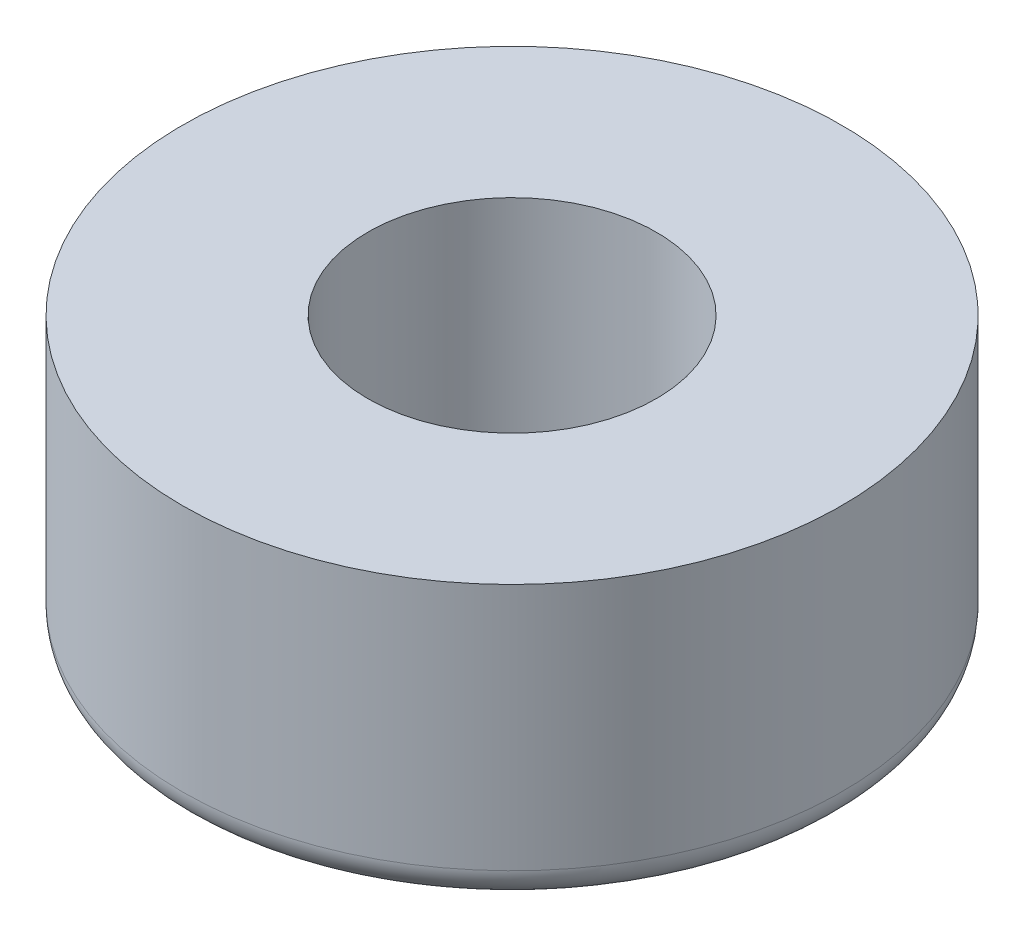
ISO-10303-21;
HEADER;
FILE_DESCRIPTION(('STEP AP214'),'2;1');
FILE_NAME('part.step','',(''),(''),'','','');
FILE_SCHEMA(('AUTOMOTIVE_DESIGN { 1 0 10303 214 1 1 1 1 }'));
ENDSEC;
DATA;
#1=APPLICATION_CONTEXT('core data for automotive mechanical design processes');
#2=APPLICATION_PROTOCOL_DEFINITION('international standard','automotive_design',2000,#1);
#3=PRODUCT_CONTEXT('',#1,'mechanical');
#4=PRODUCT('Part','Part','',(#3));
#5=PRODUCT_RELATED_PRODUCT_CATEGORY('part','',(#4));
#6=PRODUCT_DEFINITION_FORMATION('','',#4);
#7=PRODUCT_DEFINITION_CONTEXT('part definition',#1,'design');
#8=PRODUCT_DEFINITION('design','',#6,#7);
#9=PRODUCT_DEFINITION_SHAPE('','',#8);
#10=(LENGTH_UNIT() NAMED_UNIT(*) SI_UNIT(.MILLI.,.METRE.));
#11=(NAMED_UNIT(*) PLANE_ANGLE_UNIT() SI_UNIT($,.RADIAN.));
#12=(NAMED_UNIT(*) SI_UNIT($,.STERADIAN.) SOLID_ANGLE_UNIT());
#13=UNCERTAINTY_MEASURE_WITH_UNIT(LENGTH_MEASURE(1.E-05),#10,'distance_accuracy_value','');
#14=(GEOMETRIC_REPRESENTATION_CONTEXT(3) GLOBAL_UNCERTAINTY_ASSIGNED_CONTEXT((#13)) GLOBAL_UNIT_ASSIGNED_CONTEXT((#10,
#11,#12)) REPRESENTATION_CONTEXT('',''));
#15=CARTESIAN_POINT('',(0.,0.,0.));
#16=DIRECTION('',(0.,0.,1.));
#17=DIRECTION('',(1.,0.,0.));
#18=AXIS2_PLACEMENT_3D('',#15,#16,#17);
#19=CARTESIAN_POINT('',(0.,6.731,0.));
#20=DIRECTION('',(0.,1.,0.));
#21=DIRECTION('',(0.,0.,1.));
#22=AXIS2_PLACEMENT_3D('',#19,#20,#21);
#23=PLANE('',#22);
#24=CARTESIAN_POINT('',(0.,6.731,0.));
#25=DIRECTION('',(0.,1.,0.));
#26=DIRECTION('',(0.,0.,1.));
#27=AXIS2_PLACEMENT_3D('',#24,#25,#26);
#28=CIRCLE('',#27,7.9375);
#29=CARTESIAN_POINT('',(0.,6.731,7.9375));
#30=VERTEX_POINT('',#29);
#31=EDGE_CURVE('E42',#30,#30,#28,.T.);
#32=ORIENTED_EDGE('',*,*,#31,.T.);
#33=EDGE_LOOP('',(#32));
#34=FACE_BOUND('',#33,.T.);
#35=CARTESIAN_POINT('',(0.,6.731,0.));
#36=DIRECTION('',(0.,1.,0.));
#37=DIRECTION('',(0.,0.,1.));
#38=AXIS2_PLACEMENT_3D('',#35,#36,#37);
#39=CIRCLE('',#38,3.475000035);
#40=CARTESIAN_POINT('',(0.,6.731,3.475000035));
#41=VERTEX_POINT('',#40);
#42=EDGE_CURVE('E46',#41,#41,#39,.T.);
#43=ORIENTED_EDGE('',*,*,#42,.F.);
#44=EDGE_LOOP('',(#43));
#45=FACE_BOUND('',#44,.T.);
#46=ADVANCED_FACE('F31',(#34,#45),#23,.T.);
#47=CARTESIAN_POINT('',(0.,0.,0.));
#48=DIRECTION('',(0.,1.,0.));
#49=DIRECTION('',(0.,0.,1.));
#50=AXIS2_PLACEMENT_3D('',#47,#48,#49);
#51=PLANE('',#50);
#52=CARTESIAN_POINT('',(0.,0.,0.));
#53=DIRECTION('',(0.,1.,0.));
#54=DIRECTION('',(0.,0.,1.));
#55=AXIS2_PLACEMENT_3D('',#52,#53,#54);
#56=CIRCLE('',#55,7.1775);
#57=CARTESIAN_POINT('',(0.,0.,7.1775));
#58=VERTEX_POINT('',#57);
#59=EDGE_CURVE('E10',#58,#58,#56,.F.);
#60=ORIENTED_EDGE('',*,*,#59,.T.);
#61=EDGE_LOOP('',(#60));
#62=FACE_BOUND('',#61,.T.);
#63=CARTESIAN_POINT('',(0.,0.,0.));
#64=DIRECTION('',(0.,1.,0.));
#65=DIRECTION('',(0.,0.,1.));
#66=AXIS2_PLACEMENT_3D('',#63,#64,#65);
#67=CIRCLE('',#66,3.475000035);
#68=CARTESIAN_POINT('',(0.,0.,3.475000035));
#69=VERTEX_POINT('',#68);
#70=EDGE_CURVE('E49',#69,#69,#67,.T.);
#71=ORIENTED_EDGE('',*,*,#70,.T.);
#72=EDGE_LOOP('',(#71));
#73=FACE_BOUND('',#72,.T.);
#74=ADVANCED_FACE('F59',(#62,#73),#51,.F.);
#75=CARTESIAN_POINT('',(0.,6.731,0.));
#76=DIRECTION('',(0.,-1.,0.));
#77=DIRECTION('',(0.,0.,-1.));
#78=AXIS2_PLACEMENT_3D('',#75,#76,#77);
#79=CYLINDRICAL_SURFACE('',#78,7.9375);
#80=CARTESIAN_POINT('',(0.,0.76,0.));
#81=DIRECTION('',(0.,1.,0.));
#82=DIRECTION('',(0.,0.,1.));
#83=AXIS2_PLACEMENT_3D('',#80,#81,#82);
#84=CIRCLE('',#83,7.9375);
#85=CARTESIAN_POINT('',(0.,0.76,7.9375));
#86=VERTEX_POINT('',#85);
#87=EDGE_CURVE('E38',#86,#86,#84,.T.);
#88=ORIENTED_EDGE('',*,*,#87,.T.);
#89=EDGE_LOOP('',(#88));
#90=FACE_BOUND('',#89,.T.);
#91=ORIENTED_EDGE('',*,*,#31,.F.);
#92=EDGE_LOOP('',(#91));
#93=FACE_BOUND('',#92,.T.);
#94=ADVANCED_FACE('F66',(#90,#93),#79,.T.);
#95=CARTESIAN_POINT('',(0.,6.731,0.));
#96=DIRECTION('',(0.,-1.,0.));
#97=DIRECTION('',(0.,0.,-1.));
#98=AXIS2_PLACEMENT_3D('',#95,#96,#97);
#99=CYLINDRICAL_SURFACE('',#98,3.475000035);
#100=ORIENTED_EDGE('',*,*,#42,.T.);
#101=EDGE_LOOP('',(#100));
#102=FACE_BOUND('',#101,.T.);
#103=ORIENTED_EDGE('',*,*,#70,.F.);
#104=EDGE_LOOP('',(#103));
#105=FACE_BOUND('',#104,.T.);
#106=ADVANCED_FACE('F55',(#102,#105),#99,.F.);
#107=CARTESIAN_POINT('',(0.,0.76,0.));
#108=DIRECTION('',(0.,1.,0.));
#109=DIRECTION('',(0.,0.,1.));
#110=AXIS2_PLACEMENT_3D('',#107,#108,#109);
#111=TOROIDAL_SURFACE('',#110,7.1775,0.76);
#112=ORIENTED_EDGE('',*,*,#59,.F.);
#113=EDGE_LOOP('',(#112));
#114=FACE_BOUND('',#113,.T.);
#115=ORIENTED_EDGE('',*,*,#87,.F.);
#116=EDGE_LOOP('',(#115));
#117=FACE_BOUND('',#116,.T.);
#118=ADVANCED_FACE('F33',(#114,#117),#111,.T.);
#119=CLOSED_SHELL('',(#46,#74,#94,#106,#118));
#120=MANIFOLD_SOLID_BREP('B2',#119);
#121=ADVANCED_BREP_SHAPE_REPRESENTATION('',(#18,#120),#14);
#122=SHAPE_DEFINITION_REPRESENTATION(#9,#121);
ENDSEC;
END-ISO-10303-21;
